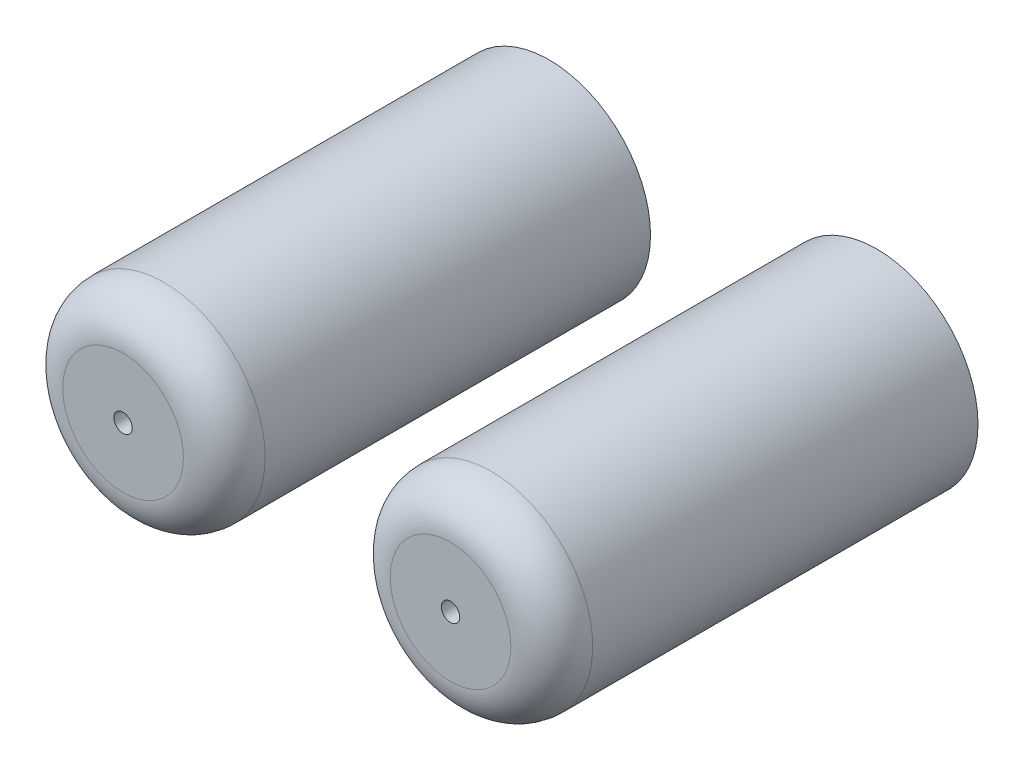
ISO-10303-21;
HEADER;
FILE_DESCRIPTION(('STEP AP214'),'2;1');
FILE_NAME('part.step','',(''),(''),'','','');
FILE_SCHEMA(('AUTOMOTIVE_DESIGN { 1 0 10303 214 1 1 1 1 }'));
ENDSEC;
DATA;
#1=APPLICATION_CONTEXT('core data for automotive mechanical design processes');
#2=APPLICATION_PROTOCOL_DEFINITION('international standard','automotive_design',2000,#1);
#3=PRODUCT_CONTEXT('',#1,'mechanical');
#4=PRODUCT('Part','Part','',(#3));
#5=PRODUCT_RELATED_PRODUCT_CATEGORY('part','',(#4));
#6=PRODUCT_DEFINITION_FORMATION('','',#4);
#7=PRODUCT_DEFINITION_CONTEXT('part definition',#1,'design');
#8=PRODUCT_DEFINITION('design','',#6,#7);
#9=PRODUCT_DEFINITION_SHAPE('','',#8);
#10=(LENGTH_UNIT() NAMED_UNIT(*) SI_UNIT(.MILLI.,.METRE.));
#11=(NAMED_UNIT(*) PLANE_ANGLE_UNIT() SI_UNIT($,.RADIAN.));
#12=(NAMED_UNIT(*) SI_UNIT($,.STERADIAN.) SOLID_ANGLE_UNIT());
#13=UNCERTAINTY_MEASURE_WITH_UNIT(LENGTH_MEASURE(1.E-05),#10,'distance_accuracy_value','');
#14=(GEOMETRIC_REPRESENTATION_CONTEXT(3) GLOBAL_UNCERTAINTY_ASSIGNED_CONTEXT((#13)) GLOBAL_UNIT_ASSIGNED_CONTEXT((#10,
#11,#12)) REPRESENTATION_CONTEXT('',''));
#15=CARTESIAN_POINT('',(0.,0.,0.));
#16=DIRECTION('',(0.,0.,1.));
#17=DIRECTION('',(1.,0.,0.));
#18=AXIS2_PLACEMENT_3D('',#15,#16,#17);
#19=CARTESIAN_POINT('',(40.04,0.,0.));
#20=DIRECTION('',(0.,0.,1.));
#21=DIRECTION('',(1.,0.,0.));
#22=AXIS2_PLACEMENT_3D('',#19,#20,#21);
#23=CYLINDRICAL_SURFACE('',#22,1.125);
#24=CARTESIAN_POINT('',(40.04,0.,20.234122918276));
#25=DIRECTION('',(0.,0.,-1.));
#26=DIRECTION('',(-1.,0.,0.));
#27=AXIS2_PLACEMENT_3D('',#24,#25,#26);
#28=CIRCLE('',#27,1.125);
#29=CARTESIAN_POINT('',(38.915,0.,20.234122918276));
#30=VERTEX_POINT('',#29);
#31=EDGE_CURVE('E11',#30,#30,#28,.T.);
#32=ORIENTED_EDGE('',*,*,#31,.T.);
#33=EDGE_LOOP('',(#32));
#34=FACE_BOUND('',#33,.T.);
#35=CARTESIAN_POINT('',(40.04,0.,52.11));
#36=DIRECTION('',(0.,0.,1.));
#37=DIRECTION('',(1.,0.,0.));
#38=AXIS2_PLACEMENT_3D('',#35,#36,#37);
#39=CIRCLE('',#38,1.125);
#40=CARTESIAN_POINT('',(41.165,0.,52.11));
#41=VERTEX_POINT('',#40);
#42=EDGE_CURVE('E70',#41,#41,#39,.T.);
#43=ORIENTED_EDGE('',*,*,#42,.T.);
#44=EDGE_LOOP('',(#43));
#45=FACE_BOUND('',#44,.T.);
#46=ADVANCED_FACE('F44',(#34,#45),#23,.F.);
#47=CARTESIAN_POINT('',(40.04,0.,52.11));
#48=DIRECTION('',(0.,0.,-1.));
#49=DIRECTION('',(-1.,0.,0.));
#50=AXIS2_PLACEMENT_3D('',#47,#48,#49);
#51=CYLINDRICAL_SURFACE('',#50,12.375);
#52=CARTESIAN_POINT('',(40.04,0.,47.11));
#53=DIRECTION('',(0.,0.,1.));
#54=DIRECTION('',(1.,0.,0.));
#55=AXIS2_PLACEMENT_3D('',#52,#53,#54);
#56=CIRCLE('',#55,12.375);
#57=CARTESIAN_POINT('',(52.415,0.,47.11));
#58=VERTEX_POINT('',#57);
#59=EDGE_CURVE('E59',#58,#58,#56,.F.);
#60=ORIENTED_EDGE('',*,*,#59,.T.);
#61=EDGE_LOOP('',(#60));
#62=FACE_BOUND('',#61,.T.);
#63=CARTESIAN_POINT('',(40.04,0.,0.));
#64=DIRECTION('',(0.,0.,1.));
#65=DIRECTION('',(1.,0.,0.));
#66=AXIS2_PLACEMENT_3D('',#63,#64,#65);
#67=CIRCLE('',#66,12.375);
#68=CARTESIAN_POINT('',(52.415,0.,0.));
#69=VERTEX_POINT('',#68);
#70=EDGE_CURVE('E67',#69,#69,#67,.T.);
#71=ORIENTED_EDGE('',*,*,#70,.T.);
#72=EDGE_LOOP('',(#71));
#73=FACE_BOUND('',#72,.T.);
#74=ADVANCED_FACE('F87',(#62,#73),#51,.T.);
#75=CARTESIAN_POINT('',(40.04,0.,52.11));
#76=DIRECTION('',(0.,0.,1.));
#77=DIRECTION('',(1.,0.,0.));
#78=AXIS2_PLACEMENT_3D('',#75,#76,#77);
#79=PLANE('',#78);
#80=ORIENTED_EDGE('',*,*,#42,.F.);
#81=EDGE_LOOP('',(#80));
#82=FACE_BOUND('',#81,.T.);
#83=CARTESIAN_POINT('',(40.04,0.,52.11));
#84=DIRECTION('',(0.,0.,1.));
#85=DIRECTION('',(1.,0.,0.));
#86=AXIS2_PLACEMENT_3D('',#83,#84,#85);
#87=CIRCLE('',#86,7.375);
#88=CARTESIAN_POINT('',(47.415,0.,52.11));
#89=VERTEX_POINT('',#88);
#90=EDGE_CURVE('E64',#89,#89,#87,.T.);
#91=ORIENTED_EDGE('',*,*,#90,.T.);
#92=EDGE_LOOP('',(#91));
#93=FACE_BOUND('',#92,.T.);
#94=ADVANCED_FACE('F83',(#82,#93),#79,.T.);
#95=CARTESIAN_POINT('',(40.04,0.,0.));
#96=DIRECTION('',(0.,0.,1.));
#97=DIRECTION('',(1.,0.,0.));
#98=AXIS2_PLACEMENT_3D('',#95,#96,#97);
#99=PLANE('',#98);
#100=CARTESIAN_POINT('',(40.04,0.,0.));
#101=DIRECTION('',(0.,0.,-1.));
#102=DIRECTION('',(-1.,0.,0.));
#103=AXIS2_PLACEMENT_3D('',#100,#101,#102);
#104=CIRCLE('',#103,1.5);
#105=CARTESIAN_POINT('',(38.54,0.,0.));
#106=VERTEX_POINT('',#105);
#107=EDGE_CURVE('E73',#106,#106,#104,.T.);
#108=ORIENTED_EDGE('',*,*,#107,.F.);
#109=EDGE_LOOP('',(#108));
#110=FACE_BOUND('',#109,.T.);
#111=ORIENTED_EDGE('',*,*,#70,.F.);
#112=EDGE_LOOP('',(#111));
#113=FACE_BOUND('',#112,.T.);
#114=ADVANCED_FACE('F79',(#110,#113),#99,.F.);
#115=CARTESIAN_POINT('',(40.04,0.,47.11));
#116=DIRECTION('',(0.,0.,1.));
#117=DIRECTION('',(1.,0.,0.));
#118=AXIS2_PLACEMENT_3D('',#115,#116,#117);
#119=TOROIDAL_SURFACE('',#118,7.375,5.);
#120=ORIENTED_EDGE('',*,*,#59,.F.);
#121=EDGE_LOOP('',(#120));
#122=FACE_BOUND('',#121,.T.);
#123=ORIENTED_EDGE('',*,*,#90,.F.);
#124=EDGE_LOOP('',(#123));
#125=FACE_BOUND('',#124,.T.);
#126=ADVANCED_FACE('F82',(#122,#125),#119,.T.);
#127=CARTESIAN_POINT('',(40.04,0.,20.));
#128=DIRECTION('',(0.,0.,-1.));
#129=DIRECTION('',(-1.,0.,0.));
#130=AXIS2_PLACEMENT_3D('',#127,#128,#129);
#131=CYLINDRICAL_SURFACE('',#130,1.5);
#132=CARTESIAN_POINT('',(40.04,0.,19.75));
#133=DIRECTION('',(0.,0.,-1.));
#134=DIRECTION('',(-1.,0.,0.));
#135=AXIS2_PLACEMENT_3D('',#132,#133,#134);
#136=CIRCLE('',#135,1.5);
#137=CARTESIAN_POINT('',(38.54,0.,19.75));
#138=VERTEX_POINT('',#137);
#139=EDGE_CURVE('E55',#138,#138,#136,.F.);
#140=ORIENTED_EDGE('',*,*,#139,.T.);
#141=EDGE_LOOP('',(#140));
#142=FACE_BOUND('',#141,.T.);
#143=ORIENTED_EDGE('',*,*,#107,.T.);
#144=EDGE_LOOP('',(#143));
#145=FACE_BOUND('',#144,.T.);
#146=ADVANCED_FACE('F77',(#142,#145),#131,.F.);
#147=CARTESIAN_POINT('',(40.04,0.,19.75));
#148=DIRECTION('',(0.,0.,-1.));
#149=DIRECTION('',(-1.,0.,0.));
#150=AXIS2_PLACEMENT_3D('',#147,#148,#149);
#151=TOROIDAL_SURFACE('',#150,1.25,0.25);
#152=CARTESIAN_POINT('',(40.04,0.,19.992061459138));
#153=DIRECTION('',(0.,0.,-1.));
#154=DIRECTION('',(-1.,0.,0.));
#155=AXIS2_PLACEMENT_3D('',#152,#153,#154);
#156=CIRCLE('',#155,1.31249999999999);
#157=CARTESIAN_POINT('',(38.7275,0.,19.992061459138));
#158=VERTEX_POINT('',#157);
#159=EDGE_CURVE('E51',#158,#158,#156,.F.);
#160=ORIENTED_EDGE('',*,*,#159,.T.);
#161=EDGE_LOOP('',(#160));
#162=FACE_BOUND('',#161,.T.);
#163=ORIENTED_EDGE('',*,*,#139,.F.);
#164=EDGE_LOOP('',(#163));
#165=FACE_BOUND('',#164,.T.);
#166=ADVANCED_FACE('F102',(#162,#165),#151,.F.);
#167=CARTESIAN_POINT('',(40.04,0.,20.234122918276));
#168=DIRECTION('',(0.,0.,-1.));
#169=DIRECTION('',(-1.,0.,0.));
#170=AXIS2_PLACEMENT_3D('',#167,#168,#169);
#171=TOROIDAL_SURFACE('',#170,1.37499999999998,0.25);
#172=ORIENTED_EDGE('',*,*,#31,.F.);
#173=EDGE_LOOP('',(#172));
#174=FACE_BOUND('',#173,.T.);
#175=ORIENTED_EDGE('',*,*,#159,.F.);
#176=EDGE_LOOP('',(#175));
#177=FACE_BOUND('',#176,.T.);
#178=ADVANCED_FACE('F46',(#174,#177),#171,.T.);
#179=CLOSED_SHELL('',(#46,#74,#94,#114,#126,#146,#166,#178));
#180=MANIFOLD_SOLID_BREP('B2',#179);
#181=CARTESIAN_POINT('',(0.,0.,0.));
#182=DIRECTION('',(0.,0.,1.));
#183=DIRECTION('',(1.,0.,0.));
#184=AXIS2_PLACEMENT_3D('',#181,#182,#183);
#185=CYLINDRICAL_SURFACE('',#184,1.125);
#186=CARTESIAN_POINT('',(0.,0.,20.25));
#187=DIRECTION('',(0.,0.,-1.));
#188=DIRECTION('',(-1.,0.,0.));
#189=AXIS2_PLACEMENT_3D('',#186,#187,#188);
#190=CIRCLE('',#189,1.125);
#191=CARTESIAN_POINT('',(-1.125,0.,20.25));
#192=VERTEX_POINT('',#191);
#193=EDGE_CURVE('E176',#192,#192,#190,.T.);
#194=ORIENTED_EDGE('',*,*,#193,.T.);
#195=EDGE_LOOP('',(#194));
#196=FACE_BOUND('',#195,.T.);
#197=CARTESIAN_POINT('',(0.,0.,52.11));
#198=DIRECTION('',(0.,0.,1.));
#199=DIRECTION('',(1.,0.,0.));
#200=AXIS2_PLACEMENT_3D('',#197,#198,#199);
#201=CIRCLE('',#200,1.125);
#202=CARTESIAN_POINT('',(1.125,0.,52.11));
#203=VERTEX_POINT('',#202);
#204=EDGE_CURVE('E191',#203,#203,#201,.T.);
#205=ORIENTED_EDGE('',*,*,#204,.T.);
#206=EDGE_LOOP('',(#205));
#207=FACE_BOUND('',#206,.T.);
#208=ADVANCED_FACE('F165',(#196,#207),#185,.F.);
#209=CARTESIAN_POINT('',(0.,0.,52.11));
#210=DIRECTION('',(0.,0.,-1.));
#211=DIRECTION('',(-1.,0.,0.));
#212=AXIS2_PLACEMENT_3D('',#209,#210,#211);
#213=CYLINDRICAL_SURFACE('',#212,12.375);
#214=CARTESIAN_POINT('',(0.,0.,47.11));
#215=DIRECTION('',(0.,0.,1.));
#216=DIRECTION('',(1.,0.,0.));
#217=AXIS2_PLACEMENT_3D('',#214,#215,#216);
#218=CIRCLE('',#217,12.375);
#219=CARTESIAN_POINT('',(12.375,0.,47.11));
#220=VERTEX_POINT('',#219);
#221=EDGE_CURVE('E180',#220,#220,#218,.F.);
#222=ORIENTED_EDGE('',*,*,#221,.T.);
#223=EDGE_LOOP('',(#222));
#224=FACE_BOUND('',#223,.T.);
#225=CARTESIAN_POINT('',(0.,0.,0.));
#226=DIRECTION('',(0.,0.,1.));
#227=DIRECTION('',(1.,0.,0.));
#228=AXIS2_PLACEMENT_3D('',#225,#226,#227);
#229=CIRCLE('',#228,12.375);
#230=CARTESIAN_POINT('',(12.375,0.,0.));
#231=VERTEX_POINT('',#230);
#232=EDGE_CURVE('E188',#231,#231,#229,.T.);
#233=ORIENTED_EDGE('',*,*,#232,.T.);
#234=EDGE_LOOP('',(#233));
#235=FACE_BOUND('',#234,.T.);
#236=ADVANCED_FACE('F208',(#224,#235),#213,.T.);
#237=CARTESIAN_POINT('',(0.,0.,52.11));
#238=DIRECTION('',(0.,0.,1.));
#239=DIRECTION('',(1.,0.,0.));
#240=AXIS2_PLACEMENT_3D('',#237,#238,#239);
#241=PLANE('',#240);
#242=ORIENTED_EDGE('',*,*,#204,.F.);
#243=EDGE_LOOP('',(#242));
#244=FACE_BOUND('',#243,.T.);
#245=CARTESIAN_POINT('',(0.,0.,52.11));
#246=DIRECTION('',(0.,0.,1.));
#247=DIRECTION('',(1.,0.,0.));
#248=AXIS2_PLACEMENT_3D('',#245,#246,#247);
#249=CIRCLE('',#248,7.375);
#250=CARTESIAN_POINT('',(7.375,0.,52.11));
#251=VERTEX_POINT('',#250);
#252=EDGE_CURVE('E185',#251,#251,#249,.T.);
#253=ORIENTED_EDGE('',*,*,#252,.T.);
#254=EDGE_LOOP('',(#253));
#255=FACE_BOUND('',#254,.T.);
#256=ADVANCED_FACE('F204',(#244,#255),#241,.T.);
#257=CARTESIAN_POINT('',(0.,0.,0.));
#258=DIRECTION('',(0.,0.,1.));
#259=DIRECTION('',(1.,0.,0.));
#260=AXIS2_PLACEMENT_3D('',#257,#258,#259);
#261=PLANE('',#260);
#262=CARTESIAN_POINT('',(0.,0.,0.));
#263=DIRECTION('',(0.,0.,-1.));
#264=DIRECTION('',(-1.,0.,0.));
#265=AXIS2_PLACEMENT_3D('',#262,#263,#264);
#266=CIRCLE('',#265,1.5);
#267=CARTESIAN_POINT('',(-1.5,0.,0.));
#268=VERTEX_POINT('',#267);
#269=EDGE_CURVE('E194',#268,#268,#266,.T.);
#270=ORIENTED_EDGE('',*,*,#269,.F.);
#271=EDGE_LOOP('',(#270));
#272=FACE_BOUND('',#271,.T.);
#273=ORIENTED_EDGE('',*,*,#232,.F.);
#274=EDGE_LOOP('',(#273));
#275=FACE_BOUND('',#274,.T.);
#276=ADVANCED_FACE('F200',(#272,#275),#261,.F.);
#277=CARTESIAN_POINT('',(0.,0.,47.11));
#278=DIRECTION('',(0.,0.,1.));
#279=DIRECTION('',(1.,0.,0.));
#280=AXIS2_PLACEMENT_3D('',#277,#278,#279);
#281=TOROIDAL_SURFACE('',#280,7.375,5.);
#282=ORIENTED_EDGE('',*,*,#221,.F.);
#283=EDGE_LOOP('',(#282));
#284=FACE_BOUND('',#283,.T.);
#285=ORIENTED_EDGE('',*,*,#252,.F.);
#286=EDGE_LOOP('',(#285));
#287=FACE_BOUND('',#286,.T.);
#288=ADVANCED_FACE('F203',(#284,#287),#281,.T.);
#289=CARTESIAN_POINT('',(0.,0.,20.));
#290=DIRECTION('',(0.,0.,-1.));
#291=DIRECTION('',(-1.,0.,0.));
#292=AXIS2_PLACEMENT_3D('',#289,#290,#291);
#293=CYLINDRICAL_SURFACE('',#292,1.5);
#294=CARTESIAN_POINT('',(0.,0.,19.765877081724));
#295=DIRECTION('',(0.,0.,-1.));
#296=DIRECTION('',(-1.,0.,0.));
#297=AXIS2_PLACEMENT_3D('',#294,#295,#296);
#298=CIRCLE('',#297,1.5);
#299=CARTESIAN_POINT('',(-1.5,0.,19.765877081724));
#300=VERTEX_POINT('',#299);
#301=EDGE_CURVE('E43',#300,#300,#298,.F.);
#302=ORIENTED_EDGE('',*,*,#301,.T.);
#303=EDGE_LOOP('',(#302));
#304=FACE_BOUND('',#303,.T.);
#305=ORIENTED_EDGE('',*,*,#269,.T.);
#306=EDGE_LOOP('',(#305));
#307=FACE_BOUND('',#306,.T.);
#308=ADVANCED_FACE('F198',(#304,#307),#293,.F.);
#309=CARTESIAN_POINT('',(0.,0.,20.25));
#310=DIRECTION('',(0.,0.,-1.));
#311=DIRECTION('',(-1.,0.,0.));
#312=AXIS2_PLACEMENT_3D('',#309,#310,#311);
#313=TOROIDAL_SURFACE('',#312,1.375,0.25);
#314=CARTESIAN_POINT('',(0.,0.,20.007938540862));
#315=DIRECTION('',(0.,0.,1.));
#316=DIRECTION('',(1.,0.,0.));
#317=AXIS2_PLACEMENT_3D('',#314,#315,#316);
#318=CIRCLE('',#317,1.31250000000001);
#319=CARTESIAN_POINT('',(1.31250000000001,0.,20.007938540862));
#320=VERTEX_POINT('',#319);
#321=EDGE_CURVE('E172',#320,#320,#318,.F.);
#322=ORIENTED_EDGE('',*,*,#321,.T.);
#323=EDGE_LOOP('',(#322));
#324=FACE_BOUND('',#323,.T.);
#325=ORIENTED_EDGE('',*,*,#193,.F.);
#326=EDGE_LOOP('',(#325));
#327=FACE_BOUND('',#326,.T.);
#328=ADVANCED_FACE('F224',(#324,#327),#313,.T.);
#329=CARTESIAN_POINT('',(0.,0.,19.765877081724));
#330=DIRECTION('',(0.,0.,-1.));
#331=DIRECTION('',(-1.,0.,0.));
#332=AXIS2_PLACEMENT_3D('',#329,#330,#331);
#333=TOROIDAL_SURFACE('',#332,1.25000000000002,0.25);
#334=ORIENTED_EDGE('',*,*,#301,.F.);
#335=EDGE_LOOP('',(#334));
#336=FACE_BOUND('',#335,.T.);
#337=ORIENTED_EDGE('',*,*,#321,.F.);
#338=EDGE_LOOP('',(#337));
#339=FACE_BOUND('',#338,.T.);
#340=ADVANCED_FACE('F167',(#336,#339),#333,.F.);
#341=CLOSED_SHELL('',(#208,#236,#256,#276,#288,#308,#328,#340));
#342=MANIFOLD_SOLID_BREP('B6',#341);
#343=ADVANCED_BREP_SHAPE_REPRESENTATION('',(#18,#180,#342),#14);
#344=SHAPE_DEFINITION_REPRESENTATION(#9,#343);
ENDSEC;
END-ISO-10303-21;
